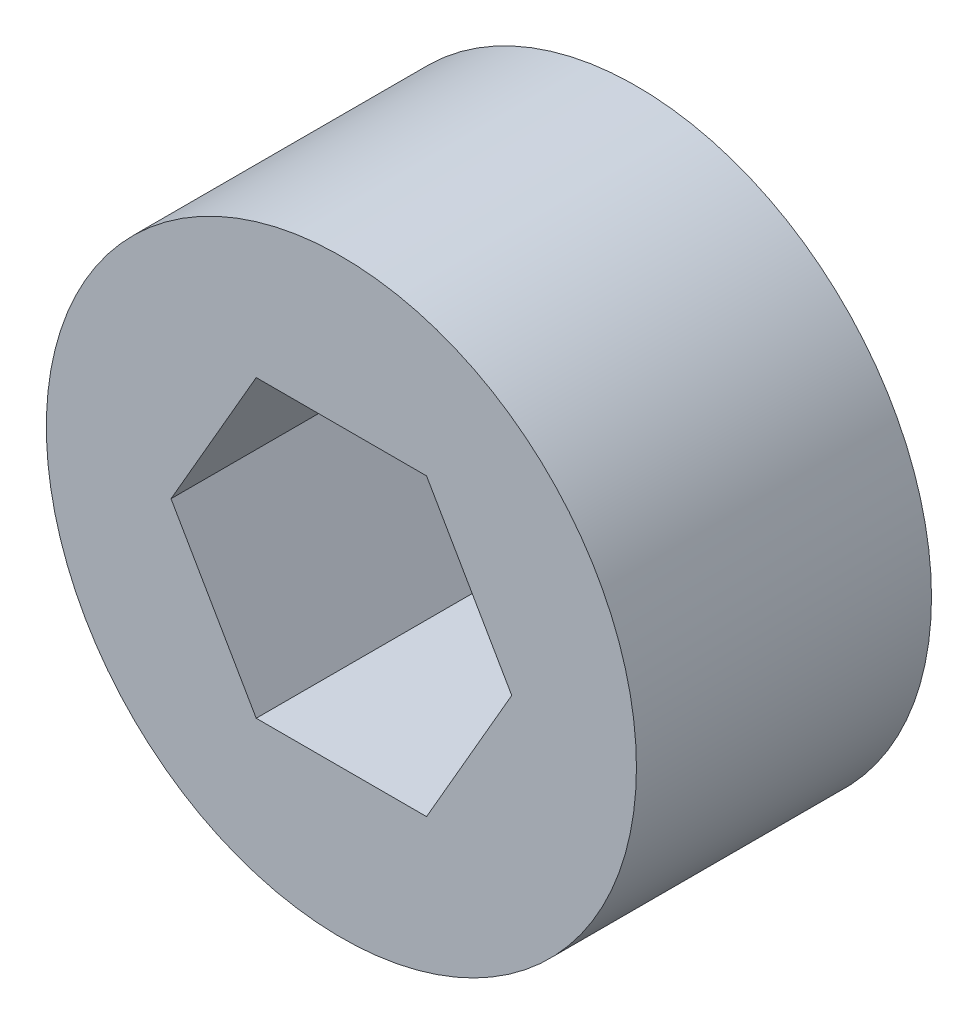
ISO-10303-21;
HEADER;
FILE_DESCRIPTION(('STEP AP214'),'2;1');
FILE_NAME('part.step','',(''),(''),'','','');
FILE_SCHEMA(('AUTOMOTIVE_DESIGN { 1 0 10303 214 1 1 1 1 }'));
ENDSEC;
DATA;
#1=APPLICATION_CONTEXT('core data for automotive mechanical design processes');
#2=APPLICATION_PROTOCOL_DEFINITION('international standard','automotive_design',2000,#1);
#3=PRODUCT_CONTEXT('',#1,'mechanical');
#4=PRODUCT('Part','Part','',(#3));
#5=PRODUCT_RELATED_PRODUCT_CATEGORY('part','',(#4));
#6=PRODUCT_DEFINITION_FORMATION('','',#4);
#7=PRODUCT_DEFINITION_CONTEXT('part definition',#1,'design');
#8=PRODUCT_DEFINITION('design','',#6,#7);
#9=PRODUCT_DEFINITION_SHAPE('','',#8);
#10=(LENGTH_UNIT() NAMED_UNIT(*) SI_UNIT(.MILLI.,.METRE.));
#11=(NAMED_UNIT(*) PLANE_ANGLE_UNIT() SI_UNIT($,.RADIAN.));
#12=(NAMED_UNIT(*) SI_UNIT($,.STERADIAN.) SOLID_ANGLE_UNIT());
#13=UNCERTAINTY_MEASURE_WITH_UNIT(LENGTH_MEASURE(1.E-05),#10,'distance_accuracy_value','');
#14=(GEOMETRIC_REPRESENTATION_CONTEXT(3) GLOBAL_UNCERTAINTY_ASSIGNED_CONTEXT((#13)) GLOBAL_UNIT_ASSIGNED_CONTEXT((#10,
#11,#12)) REPRESENTATION_CONTEXT('',''));
#15=CARTESIAN_POINT('',(0.,0.,0.));
#16=DIRECTION('',(0.,0.,1.));
#17=DIRECTION('',(1.,0.,0.));
#18=AXIS2_PLACEMENT_3D('',#15,#16,#17);
#19=CARTESIAN_POINT('',(0.,0.,12.7));
#20=DIRECTION('',(0.,0.,1.));
#21=DIRECTION('',(1.,0.,0.));
#22=AXIS2_PLACEMENT_3D('',#19,#20,#21);
#23=PLANE('',#22);
#24=CARTESIAN_POINT('',(0.,0.,12.7));
#25=DIRECTION('',(0.,0.,1.));
#26=DIRECTION('',(1.,0.,0.));
#27=AXIS2_PLACEMENT_3D('',#24,#25,#26);
#28=CIRCLE('',#27,12.7);
#29=CARTESIAN_POINT('',(12.7,0.,12.7));
#30=VERTEX_POINT('',#29);
#31=EDGE_CURVE('E11',#30,#30,#28,.T.);
#32=ORIENTED_EDGE('',*,*,#31,.T.);
#33=EDGE_LOOP('',(#32));
#34=FACE_BOUND('',#33,.T.);
#35=DIRECTION('',(-0.500000000000001,0.866025403784438,0.));
#36=VECTOR('',#35,1.);
#37=CARTESIAN_POINT('',(7.33234841870825,0.,12.7));
#38=LINE('',#37,#36);
#39=CARTESIAN_POINT('',(7.33234841870825,0.,12.7));
#40=VERTEX_POINT('',#39);
#41=CARTESIAN_POINT('',(3.66617420935411,6.35000000000001,12.7));
#42=VERTEX_POINT('',#41);
#43=EDGE_CURVE('E92',#40,#42,#38,.T.);
#44=ORIENTED_EDGE('',*,*,#43,.F.);
#45=DIRECTION('',(0.499999999999995,0.866025403784442,0.));
#46=VECTOR('',#45,1.);
#47=CARTESIAN_POINT('',(3.6661742093542,-6.34999999999996,12.7));
#48=LINE('',#47,#46);
#49=CARTESIAN_POINT('',(3.6661742093542,-6.34999999999996,12.7));
#50=VERTEX_POINT('',#49);
#51=EDGE_CURVE('E84',#50,#40,#48,.T.);
#52=ORIENTED_EDGE('',*,*,#51,.F.);
#53=DIRECTION('',(1.,0.,0.));
#54=VECTOR('',#53,1.);
#55=CARTESIAN_POINT('',(-3.66617420935407,-6.35000000000004,12.7));
#56=LINE('',#55,#54);
#57=CARTESIAN_POINT('',(-3.66617420935407,-6.35000000000004,12.7));
#58=VERTEX_POINT('',#57);
#59=EDGE_CURVE('E112',#58,#50,#56,.T.);
#60=ORIENTED_EDGE('',*,*,#59,.F.);
#61=DIRECTION('',(0.500000000000007,-0.866025403784434,0.));
#62=VECTOR('',#61,1.);
#63=CARTESIAN_POINT('',(-7.33234841870825,0.,12.7));
#64=LINE('',#63,#62);
#65=CARTESIAN_POINT('',(-7.33234841870825,0.,12.7));
#66=VERTEX_POINT('',#65);
#67=EDGE_CURVE('E110',#66,#58,#64,.T.);
#68=ORIENTED_EDGE('',*,*,#67,.F.);
#69=DIRECTION('',(-0.499999999999995,-0.866025403784442,0.));
#70=VECTOR('',#69,1.);
#71=CARTESIAN_POINT('',(-3.66617420935416,6.34999999999999,12.7));
#72=LINE('',#71,#70);
#73=CARTESIAN_POINT('',(-3.66617420935416,6.34999999999999,12.7));
#74=VERTEX_POINT('',#73);
#75=EDGE_CURVE('E106',#74,#66,#72,.T.);
#76=ORIENTED_EDGE('',*,*,#75,.F.);
#77=DIRECTION('',(-1.,0.,0.));
#78=VECTOR('',#77,1.);
#79=CARTESIAN_POINT('',(3.66617420935411,6.35000000000001,12.7));
#80=LINE('',#79,#78);
#81=EDGE_CURVE('E104',#42,#74,#80,.T.);
#82=ORIENTED_EDGE('',*,*,#81,.F.);
#83=EDGE_LOOP('',(#44,#52,#60,#68,#76,#82));
#84=FACE_BOUND('',#83,.T.);
#85=ADVANCED_FACE('F31',(#34,#84),#23,.T.);
#86=CARTESIAN_POINT('',(0.,0.,0.));
#87=DIRECTION('',(0.,0.,1.));
#88=DIRECTION('',(1.,0.,0.));
#89=AXIS2_PLACEMENT_3D('',#86,#87,#88);
#90=PLANE('',#89);
#91=CARTESIAN_POINT('',(0.,0.,0.));
#92=DIRECTION('',(0.,0.,1.));
#93=DIRECTION('',(1.,0.,0.));
#94=AXIS2_PLACEMENT_3D('',#91,#92,#93);
#95=CIRCLE('',#94,12.7);
#96=CARTESIAN_POINT('',(12.7,0.,0.));
#97=VERTEX_POINT('',#96);
#98=EDGE_CURVE('E35',#97,#97,#95,.T.);
#99=ORIENTED_EDGE('',*,*,#98,.F.);
#100=EDGE_LOOP('',(#99));
#101=FACE_BOUND('',#100,.T.);
#102=DIRECTION('',(0.499999999999995,0.866025403784442,0.));
#103=VECTOR('',#102,1.);
#104=CARTESIAN_POINT('',(3.6661742093542,-6.34999999999996,0.));
#105=LINE('',#104,#103);
#106=CARTESIAN_POINT('',(3.6661742093542,-6.34999999999996,0.));
#107=VERTEX_POINT('',#106);
#108=CARTESIAN_POINT('',(7.33234841870825,0.,0.));
#109=VERTEX_POINT('',#108);
#110=EDGE_CURVE('E54',#107,#109,#105,.T.);
#111=ORIENTED_EDGE('',*,*,#110,.T.);
#112=DIRECTION('',(-0.500000000000001,0.866025403784438,0.));
#113=VECTOR('',#112,1.);
#114=CARTESIAN_POINT('',(7.33234841870825,0.,0.));
#115=LINE('',#114,#113);
#116=CARTESIAN_POINT('',(3.66617420935411,6.35000000000001,0.));
#117=VERTEX_POINT('',#116);
#118=EDGE_CURVE('E99',#109,#117,#115,.T.);
#119=ORIENTED_EDGE('',*,*,#118,.T.);
#120=DIRECTION('',(-1.,0.,0.));
#121=VECTOR('',#120,1.);
#122=CARTESIAN_POINT('',(3.66617420935411,6.35000000000001,0.));
#123=LINE('',#122,#121);
#124=CARTESIAN_POINT('',(-3.66617420935416,6.34999999999999,0.));
#125=VERTEX_POINT('',#124);
#126=EDGE_CURVE('E116',#117,#125,#123,.T.);
#127=ORIENTED_EDGE('',*,*,#126,.T.);
#128=DIRECTION('',(-0.499999999999995,-0.866025403784442,0.));
#129=VECTOR('',#128,1.);
#130=CARTESIAN_POINT('',(-3.66617420935416,6.34999999999999,0.));
#131=LINE('',#130,#129);
#132=CARTESIAN_POINT('',(-7.33234841870825,0.,0.));
#133=VERTEX_POINT('',#132);
#134=EDGE_CURVE('E119',#125,#133,#131,.T.);
#135=ORIENTED_EDGE('',*,*,#134,.T.);
#136=DIRECTION('',(0.500000000000007,-0.866025403784434,0.));
#137=VECTOR('',#136,1.);
#138=CARTESIAN_POINT('',(-7.33234841870825,0.,0.));
#139=LINE('',#138,#137);
#140=CARTESIAN_POINT('',(-3.66617420935407,-6.35000000000004,0.));
#141=VERTEX_POINT('',#140);
#142=EDGE_CURVE('E122',#133,#141,#139,.T.);
#143=ORIENTED_EDGE('',*,*,#142,.T.);
#144=DIRECTION('',(1.,0.,0.));
#145=VECTOR('',#144,1.);
#146=CARTESIAN_POINT('',(-3.66617420935407,-6.35000000000004,0.));
#147=LINE('',#146,#145);
#148=EDGE_CURVE('E93',#141,#107,#147,.T.);
#149=ORIENTED_EDGE('',*,*,#148,.T.);
#150=EDGE_LOOP('',(#111,#119,#127,#135,#143,#149));
#151=FACE_BOUND('',#150,.T.);
#152=ADVANCED_FACE('F139',(#101,#151),#90,.F.);
#153=CARTESIAN_POINT('',(0.,0.,12.7));
#154=DIRECTION('',(0.,0.,-1.));
#155=DIRECTION('',(-1.,0.,0.));
#156=AXIS2_PLACEMENT_3D('',#153,#154,#155);
#157=CYLINDRICAL_SURFACE('',#156,12.7);
#158=ORIENTED_EDGE('',*,*,#31,.F.);
#159=EDGE_LOOP('',(#158));
#160=FACE_BOUND('',#159,.T.);
#161=ORIENTED_EDGE('',*,*,#98,.T.);
#162=EDGE_LOOP('',(#161));
#163=FACE_BOUND('',#162,.T.);
#164=ADVANCED_FACE('F33',(#160,#163),#157,.T.);
#165=CARTESIAN_POINT('',(3.6661742093542,-6.34999999999996,12.7));
#166=DIRECTION('',(-0.866025403784441,0.499999999999995,0.));
#167=DIRECTION('',(-0.499999999999995,-0.866025403784442,0.));
#168=AXIS2_PLACEMENT_3D('',#165,#166,#167);
#169=PLANE('',#168);
#170=ORIENTED_EDGE('',*,*,#110,.F.);
#171=DIRECTION('',(0.,0.,-1.));
#172=VECTOR('',#171,1.);
#173=CARTESIAN_POINT('',(3.6661742093542,-6.34999999999996,12.7));
#174=LINE('',#173,#172);
#175=EDGE_CURVE('E88',#50,#107,#174,.T.);
#176=ORIENTED_EDGE('',*,*,#175,.F.);
#177=ORIENTED_EDGE('',*,*,#51,.T.);
#178=DIRECTION('',(0.,0.,-1.));
#179=VECTOR('',#178,1.);
#180=CARTESIAN_POINT('',(7.33234841870825,0.,12.7));
#181=LINE('',#180,#179);
#182=EDGE_CURVE('E87',#40,#109,#181,.T.);
#183=ORIENTED_EDGE('',*,*,#182,.T.);
#184=EDGE_LOOP('',(#170,#176,#177,#183));
#185=FACE_BOUND('',#184,.T.);
#186=ADVANCED_FACE('F86',(#185),#169,.T.);
#187=CARTESIAN_POINT('',(7.33234841870825,0.,12.7));
#188=DIRECTION('',(-0.866025403784438,-0.500000000000001,0.));
#189=DIRECTION('',(0.500000000000001,-0.866025403784438,0.));
#190=AXIS2_PLACEMENT_3D('',#187,#188,#189);
#191=PLANE('',#190);
#192=ORIENTED_EDGE('',*,*,#118,.F.);
#193=ORIENTED_EDGE('',*,*,#182,.F.);
#194=ORIENTED_EDGE('',*,*,#43,.T.);
#195=DIRECTION('',(0.,0.,-1.));
#196=VECTOR('',#195,1.);
#197=CARTESIAN_POINT('',(3.66617420935411,6.35000000000001,12.7));
#198=LINE('',#197,#196);
#199=EDGE_CURVE('E100',#42,#117,#198,.T.);
#200=ORIENTED_EDGE('',*,*,#199,.T.);
#201=EDGE_LOOP('',(#192,#193,#194,#200));
#202=FACE_BOUND('',#201,.T.);
#203=ADVANCED_FACE('F96',(#202),#191,.T.);
#204=CARTESIAN_POINT('',(3.66617420935411,6.35000000000001,12.7));
#205=DIRECTION('',(0.,-1.,0.));
#206=DIRECTION('',(1.,0.,0.));
#207=AXIS2_PLACEMENT_3D('',#204,#205,#206);
#208=PLANE('',#207);
#209=ORIENTED_EDGE('',*,*,#126,.F.);
#210=ORIENTED_EDGE('',*,*,#199,.F.);
#211=ORIENTED_EDGE('',*,*,#81,.T.);
#212=DIRECTION('',(0.,0.,-1.));
#213=VECTOR('',#212,1.);
#214=CARTESIAN_POINT('',(-3.66617420935416,6.34999999999999,12.7));
#215=LINE('',#214,#213);
#216=EDGE_CURVE('E131',#74,#125,#215,.T.);
#217=ORIENTED_EDGE('',*,*,#216,.T.);
#218=EDGE_LOOP('',(#209,#210,#211,#217));
#219=FACE_BOUND('',#218,.T.);
#220=ADVANCED_FACE('F135',(#219),#208,.T.);
#221=CARTESIAN_POINT('',(-3.66617420935416,6.34999999999999,12.7));
#222=DIRECTION('',(0.866025403784442,-0.499999999999995,0.));
#223=DIRECTION('',(0.499999999999995,0.866025403784442,0.));
#224=AXIS2_PLACEMENT_3D('',#221,#222,#223);
#225=PLANE('',#224);
#226=ORIENTED_EDGE('',*,*,#134,.F.);
#227=ORIENTED_EDGE('',*,*,#216,.F.);
#228=ORIENTED_EDGE('',*,*,#75,.T.);
#229=DIRECTION('',(0.,0.,-1.));
#230=VECTOR('',#229,1.);
#231=CARTESIAN_POINT('',(-7.33234841870825,0.,12.7));
#232=LINE('',#231,#230);
#233=EDGE_CURVE('E129',#66,#133,#232,.T.);
#234=ORIENTED_EDGE('',*,*,#233,.T.);
#235=EDGE_LOOP('',(#226,#227,#228,#234));
#236=FACE_BOUND('',#235,.T.);
#237=ADVANCED_FACE('F147',(#236),#225,.T.);
#238=CARTESIAN_POINT('',(-7.33234841870825,0.,12.7));
#239=DIRECTION('',(0.866025403784435,0.500000000000007,0.));
#240=DIRECTION('',(-0.500000000000007,0.866025403784435,0.));
#241=AXIS2_PLACEMENT_3D('',#238,#239,#240);
#242=PLANE('',#241);
#243=ORIENTED_EDGE('',*,*,#142,.F.);
#244=ORIENTED_EDGE('',*,*,#233,.F.);
#245=ORIENTED_EDGE('',*,*,#67,.T.);
#246=DIRECTION('',(0.,0.,-1.));
#247=VECTOR('',#246,1.);
#248=CARTESIAN_POINT('',(-3.66617420935407,-6.35000000000004,12.7));
#249=LINE('',#248,#247);
#250=EDGE_CURVE('E46',#58,#141,#249,.T.);
#251=ORIENTED_EDGE('',*,*,#250,.T.);
#252=EDGE_LOOP('',(#243,#244,#245,#251));
#253=FACE_BOUND('',#252,.T.);
#254=ADVANCED_FACE('F145',(#253),#242,.T.);
#255=CARTESIAN_POINT('',(-3.66617420935407,-6.35000000000004,12.7));
#256=DIRECTION('',(0.,1.,0.));
#257=DIRECTION('',(-1.,0.,0.));
#258=AXIS2_PLACEMENT_3D('',#255,#256,#257);
#259=PLANE('',#258);
#260=ORIENTED_EDGE('',*,*,#148,.F.);
#261=ORIENTED_EDGE('',*,*,#250,.F.);
#262=ORIENTED_EDGE('',*,*,#59,.T.);
#263=ORIENTED_EDGE('',*,*,#175,.T.);
#264=EDGE_LOOP('',(#260,#261,#262,#263));
#265=FACE_BOUND('',#264,.T.);
#266=ADVANCED_FACE('F141',(#265),#259,.T.);
#267=CLOSED_SHELL('',(#85,#152,#164,#186,#203,#220,#237,#254,#266));
#268=MANIFOLD_SOLID_BREP('B2',#267);
#269=ADVANCED_BREP_SHAPE_REPRESENTATION('',(#18,#268),#14);
#270=SHAPE_DEFINITION_REPRESENTATION(#9,#269);
ENDSEC;
END-ISO-10303-21;
